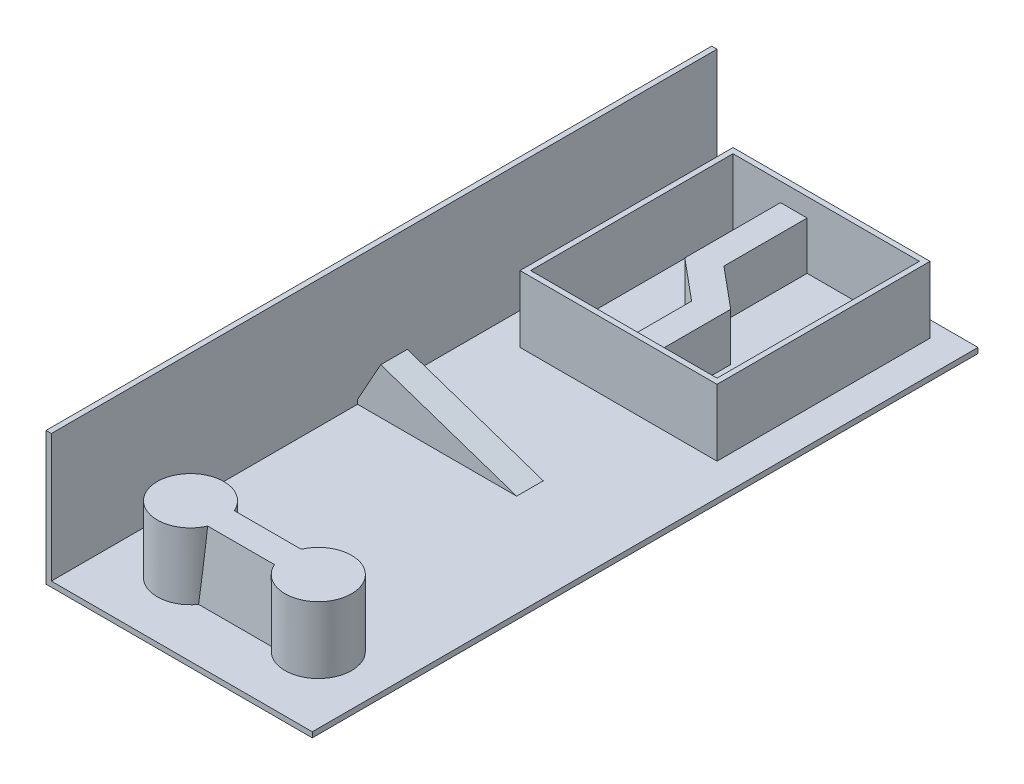
ISO-10303-21;
HEADER;
FILE_DESCRIPTION(('STEP AP214'),'2;1');
FILE_NAME('part.step','',(''),(''),'','','');
FILE_SCHEMA(('AUTOMOTIVE_DESIGN { 1 0 10303 214 1 1 1 1 }'));
ENDSEC;
DATA;
#1=APPLICATION_CONTEXT('core data for automotive mechanical design processes');
#2=APPLICATION_PROTOCOL_DEFINITION('international standard','automotive_design',2000,#1);
#3=PRODUCT_CONTEXT('',#1,'mechanical');
#4=PRODUCT('Part','Part','',(#3));
#5=PRODUCT_RELATED_PRODUCT_CATEGORY('part','',(#4));
#6=PRODUCT_DEFINITION_FORMATION('','',#4);
#7=PRODUCT_DEFINITION_CONTEXT('part definition',#1,'design');
#8=PRODUCT_DEFINITION('design','',#6,#7);
#9=PRODUCT_DEFINITION_SHAPE('','',#8);
#10=(LENGTH_UNIT() NAMED_UNIT(*) SI_UNIT(.MILLI.,.METRE.));
#11=(NAMED_UNIT(*) PLANE_ANGLE_UNIT() SI_UNIT($,.RADIAN.));
#12=(NAMED_UNIT(*) SI_UNIT($,.STERADIAN.) SOLID_ANGLE_UNIT());
#13=UNCERTAINTY_MEASURE_WITH_UNIT(LENGTH_MEASURE(1.E-05),#10,'distance_accuracy_value','');
#14=(GEOMETRIC_REPRESENTATION_CONTEXT(3) GLOBAL_UNCERTAINTY_ASSIGNED_CONTEXT((#13)) GLOBAL_UNIT_ASSIGNED_CONTEXT((#10,
#11,#12)) REPRESENTATION_CONTEXT('',''));
#15=CARTESIAN_POINT('',(0.,0.,0.));
#16=DIRECTION('',(0.,0.,1.));
#17=DIRECTION('',(1.,0.,0.));
#18=AXIS2_PLACEMENT_3D('',#15,#16,#17);
#19=CARTESIAN_POINT('',(100.,2.,250.));
#20=DIRECTION('',(0.,1.,0.));
#21=DIRECTION('',(0.,0.,1.));
#22=AXIS2_PLACEMENT_3D('',#19,#20,#21);
#23=PLANE('',#22);
#24=DIRECTION('',(1.,0.,0.));
#25=VECTOR('',#24,1.);
#26=CARTESIAN_POINT('',(14.,2.,84.));
#27=LINE('',#26,#25);
#28=CARTESIAN_POINT('',(16.,2.,84.));
#29=VERTEX_POINT('',#28);
#30=CARTESIAN_POINT('',(49.1525671305365,2.,84.));
#31=VERTEX_POINT('',#30);
#32=EDGE_CURVE('E361',#29,#31,#27,.T.);
#33=ORIENTED_EDGE('',*,*,#32,.T.);
#34=DIRECTION('',(0.,0.,1.));
#35=VECTOR('',#34,1.);
#36=CARTESIAN_POINT('',(49.1525671305365,2.,250.));
#37=LINE('',#36,#35);
#38=CARTESIAN_POINT('',(49.1525671305365,2.,56.708144933222));
#39=VERTEX_POINT('',#38);
#40=EDGE_CURVE('E11',#39,#31,#37,.T.);
#41=ORIENTED_EDGE('',*,*,#40,.F.);
#42=DIRECTION('',(0.767978867942155,0.,0.640475181716111));
#43=VECTOR('',#42,1.);
#44=CARTESIAN_POINT('',(174.216689275944,2.,161.008497066452));
#45=LINE('',#44,#43);
#46=CARTESIAN_POINT('',(33.8360225709405,2.,43.9345295779502));
#47=VERTEX_POINT('',#46);
#48=EDGE_CURVE('E43',#47,#39,#45,.T.);
#49=ORIENTED_EDGE('',*,*,#48,.F.);
#50=DIRECTION('',(0.,0.,1.));
#51=VECTOR('',#50,1.);
#52=CARTESIAN_POINT('',(33.8360225709405,2.,250.));
#53=LINE('',#52,#51);
#54=CARTESIAN_POINT('',(33.8360225709405,2.,8.));
#55=VERTEX_POINT('',#54);
#56=EDGE_CURVE('E250',#55,#47,#53,.T.);
#57=ORIENTED_EDGE('',*,*,#56,.F.);
#58=DIRECTION('',(-1.,0.,0.));
#59=VECTOR('',#58,1.);
#60=CARTESIAN_POINT('',(14.,2.,8.));
#61=LINE('',#60,#59);
#62=CARTESIAN_POINT('',(16.,2.,8.));
#63=VERTEX_POINT('',#62);
#64=EDGE_CURVE('E354',#55,#63,#61,.T.);
#65=ORIENTED_EDGE('',*,*,#64,.T.);
#66=DIRECTION('',(0.,0.,1.));
#67=VECTOR('',#66,1.);
#68=CARTESIAN_POINT('',(16.,2.,6.));
#69=LINE('',#68,#67);
#70=EDGE_CURVE('E351',#63,#29,#69,.T.);
#71=ORIENTED_EDGE('',*,*,#70,.T.);
#72=EDGE_LOOP('',(#33,#41,#49,#57,#65,#71));
#73=FACE_BOUND('',#72,.T.);
#74=ADVANCED_FACE('F34',(#73),#23,.T.);
#75=CARTESIAN_POINT('',(14.,27.,84.));
#76=DIRECTION('',(0.,0.,-1.));
#77=DIRECTION('',(-1.,0.,0.));
#78=AXIS2_PLACEMENT_3D('',#75,#76,#77);
#79=PLANE('',#78);
#80=DIRECTION('',(1.,0.,0.));
#81=VECTOR('',#80,1.);
#82=CARTESIAN_POINT('',(14.,20.,84.));
#83=LINE('',#82,#81);
#84=CARTESIAN_POINT('',(49.1525671305365,20.,84.));
#85=VERTEX_POINT('',#84);
#86=CARTESIAN_POINT('',(59.1525671305365,20.,84.));
#87=VERTEX_POINT('',#86);
#88=EDGE_CURVE('E275',#85,#87,#83,.T.);
#89=ORIENTED_EDGE('',*,*,#88,.F.);
#90=DIRECTION('',(0.,-1.,0.));
#91=VECTOR('',#90,1.);
#92=CARTESIAN_POINT('',(49.1525671305365,27.,84.));
#93=LINE('',#92,#91);
#94=EDGE_CURVE('E272',#85,#31,#93,.T.);
#95=ORIENTED_EDGE('',*,*,#94,.T.);
#96=ORIENTED_EDGE('',*,*,#32,.F.);
#97=DIRECTION('',(0.,-1.,0.));
#98=VECTOR('',#97,1.);
#99=CARTESIAN_POINT('',(16.,27.,84.));
#100=LINE('',#99,#98);
#101=CARTESIAN_POINT('',(16.,27.,84.));
#102=VERTEX_POINT('',#101);
#103=EDGE_CURVE('E329',#102,#29,#100,.T.);
#104=ORIENTED_EDGE('',*,*,#103,.F.);
#105=DIRECTION('',(1.,0.,0.));
#106=VECTOR('',#105,1.);
#107=CARTESIAN_POINT('',(14.,27.,84.));
#108=LINE('',#107,#106);
#109=CARTESIAN_POINT('',(86.,27.,84.));
#110=VERTEX_POINT('',#109);
#111=EDGE_CURVE('E343',#102,#110,#108,.T.);
#112=ORIENTED_EDGE('',*,*,#111,.T.);
#113=DIRECTION('',(0.,-1.,0.));
#114=VECTOR('',#113,1.);
#115=CARTESIAN_POINT('',(86.,27.,84.));
#116=LINE('',#115,#114);
#117=CARTESIAN_POINT('',(86.,2.,84.));
#118=VERTEX_POINT('',#117);
#119=EDGE_CURVE('E332',#110,#118,#116,.T.);
#120=ORIENTED_EDGE('',*,*,#119,.T.);
#121=CARTESIAN_POINT('',(59.1525671305365,2.,84.));
#122=VERTEX_POINT('',#121);
#123=EDGE_CURVE('E360',#122,#118,#27,.T.);
#124=ORIENTED_EDGE('',*,*,#123,.F.);
#125=DIRECTION('',(0.,-1.,0.));
#126=VECTOR('',#125,1.);
#127=CARTESIAN_POINT('',(59.1525671305365,27.,84.));
#128=LINE('',#127,#126);
#129=EDGE_CURVE('E238',#87,#122,#128,.T.);
#130=ORIENTED_EDGE('',*,*,#129,.F.);
#131=EDGE_LOOP('',(#89,#95,#96,#104,#112,#120,#124,#130));
#132=FACE_BOUND('',#131,.T.);
#133=ADVANCED_FACE('F473',(#132),#79,.T.);
#134=CARTESIAN_POINT('',(2.00000000000001,1.99999999999999,250.));
#135=DIRECTION('',(0.,-1.,0.));
#136=DIRECTION('',(0.,0.,-1.));
#137=AXIS2_PLACEMENT_3D('',#134,#135,#136);
#138=PLANE('',#137);
#139=DIRECTION('',(0.,0.,-1.));
#140=VECTOR('',#139,1.);
#141=CARTESIAN_POINT('',(2.00000000000001,1.99999999999999,250.));
#142=LINE('',#141,#140);
#143=CARTESIAN_POINT('',(2.00000000000001,1.99999999999999,125.));
#144=VERTEX_POINT('',#143);
#145=CARTESIAN_POINT('',(2.00000000000001,1.99999999999999,0.));
#146=VERTEX_POINT('',#145);
#147=EDGE_CURVE('E434',#144,#146,#142,.T.);
#148=ORIENTED_EDGE('',*,*,#147,.F.);
#149=DIRECTION('',(-1.,0.,0.));
#150=VECTOR('',#149,1.);
#151=CARTESIAN_POINT('',(2.00000000000001,1.99999999999999,125.));
#152=LINE('',#151,#150);
#153=CARTESIAN_POINT('',(61.7495471396553,1.99999999999999,125.));
#154=VERTEX_POINT('',#153);
#155=EDGE_CURVE('E293',#154,#144,#152,.T.);
#156=ORIENTED_EDGE('',*,*,#155,.F.);
#157=DIRECTION('',(0.,0.,-1.));
#158=VECTOR('',#157,1.);
#159=CARTESIAN_POINT('',(61.7495471396553,1.99999999999999,250.));
#160=LINE('',#159,#158);
#161=CARTESIAN_POINT('',(61.7495471396553,1.99999999999999,135.));
#162=VERTEX_POINT('',#161);
#163=EDGE_CURVE('E301',#154,#162,#160,.F.);
#164=ORIENTED_EDGE('',*,*,#163,.T.);
#165=DIRECTION('',(-1.,0.,0.));
#166=VECTOR('',#165,1.);
#167=CARTESIAN_POINT('',(2.00000000000001,1.99999999999999,135.));
#168=LINE('',#167,#166);
#169=CARTESIAN_POINT('',(2.00000000000001,1.99999999999999,135.));
#170=VERTEX_POINT('',#169);
#171=EDGE_CURVE('E297',#162,#170,#168,.T.);
#172=ORIENTED_EDGE('',*,*,#171,.T.);
#173=CARTESIAN_POINT('',(2.00000000000001,1.99999999999999,250.));
#174=VERTEX_POINT('',#173);
#175=EDGE_CURVE('E435',#174,#170,#142,.T.);
#176=ORIENTED_EDGE('',*,*,#175,.F.);
#177=DIRECTION('',(-1.,0.,0.));
#178=VECTOR('',#177,1.);
#179=CARTESIAN_POINT('',(2.00000000000001,1.99999999999999,250.));
#180=LINE('',#179,#178);
#181=CARTESIAN_POINT('',(100.,1.99999999999999,250.));
#182=VERTEX_POINT('',#181);
#183=EDGE_CURVE('E406',#182,#174,#180,.T.);
#184=ORIENTED_EDGE('',*,*,#183,.F.);
#185=DIRECTION('',(0.,0.,-1.));
#186=VECTOR('',#185,1.);
#187=CARTESIAN_POINT('',(100.,1.99999999999999,250.));
#188=LINE('',#187,#186);
#189=CARTESIAN_POINT('',(100.,1.99999999999999,0.));
#190=VERTEX_POINT('',#189);
#191=EDGE_CURVE('E438',#182,#190,#188,.T.);
#192=ORIENTED_EDGE('',*,*,#191,.T.);
#193=DIRECTION('',(-1.,0.,0.));
#194=VECTOR('',#193,1.);
#195=CARTESIAN_POINT('',(2.00000000000001,1.99999999999999,0.));
#196=LINE('',#195,#194);
#197=EDGE_CURVE('E419',#190,#146,#196,.T.);
#198=ORIENTED_EDGE('',*,*,#197,.T.);
#199=EDGE_LOOP('',(#148,#156,#164,#172,#176,#184,#192,#198));
#200=FACE_BOUND('',#199,.T.);
#201=CARTESIAN_POINT('',(27.,1.99999999999999,222.734483986752));
#202=DIRECTION('',(0.,-1.,0.));
#203=DIRECTION('',(0.,0.,-1.));
#204=AXIS2_PLACEMENT_3D('',#201,#202,#203);
#205=CIRCLE('',#204,12.5);
#206=CARTESIAN_POINT('',(37.2271167840721,1.99999999999999,215.547267398604));
#207=VERTEX_POINT('',#206);
#208=CARTESIAN_POINT('',(37.2271167840721,1.99999999999999,229.9217005749));
#209=VERTEX_POINT('',#208);
#210=EDGE_CURVE('E443',#207,#209,#205,.F.);
#211=ORIENTED_EDGE('',*,*,#210,.F.);
#212=DIRECTION('',(-1.,0.,0.));
#213=VECTOR('',#212,1.);
#214=CARTESIAN_POINT('',(2.00000000000001,1.99999999999999,215.547267398604));
#215=LINE('',#214,#213);
#216=CARTESIAN_POINT('',(64.7728832159279,1.99999999999999,215.547267398604));
#217=VERTEX_POINT('',#216);
#218=EDGE_CURVE('E320',#217,#207,#215,.T.);
#219=ORIENTED_EDGE('',*,*,#218,.F.);
#220=CARTESIAN_POINT('',(75.,1.99999999999999,222.734483986752));
#221=DIRECTION('',(0.,-1.,0.));
#222=DIRECTION('',(0.,0.,-1.));
#223=AXIS2_PLACEMENT_3D('',#220,#221,#222);
#224=CIRCLE('',#223,12.5);
#225=CARTESIAN_POINT('',(64.7728832159279,1.99999999999999,229.9217005749));
#226=VERTEX_POINT('',#225);
#227=EDGE_CURVE('E446',#226,#217,#224,.F.);
#228=ORIENTED_EDGE('',*,*,#227,.F.);
#229=DIRECTION('',(1.,0.,0.));
#230=VECTOR('',#229,1.);
#231=CARTESIAN_POINT('',(2.00000000000001,1.99999999999999,229.9217005749));
#232=LINE('',#231,#230);
#233=EDGE_CURVE('E322',#209,#226,#232,.T.);
#234=ORIENTED_EDGE('',*,*,#233,.F.);
#235=EDGE_LOOP('',(#211,#219,#228,#234));
#236=FACE_BOUND('',#235,.T.);
#237=DIRECTION('',(0.,0.,-1.));
#238=VECTOR('',#237,1.);
#239=CARTESIAN_POINT('',(88.,1.99999999999999,6.));
#240=LINE('',#239,#238);
#241=CARTESIAN_POINT('',(88.,1.99999999999999,86.));
#242=VERTEX_POINT('',#241);
#243=CARTESIAN_POINT('',(88.,1.99999999999999,6.00000000000001));
#244=VERTEX_POINT('',#243);
#245=EDGE_CURVE('E379',#242,#244,#240,.T.);
#246=ORIENTED_EDGE('',*,*,#245,.F.);
#247=DIRECTION('',(1.,0.,0.));
#248=VECTOR('',#247,1.);
#249=CARTESIAN_POINT('',(14.,1.99999999999999,86.));
#250=LINE('',#249,#248);
#251=CARTESIAN_POINT('',(14.,1.99999999999999,86.));
#252=VERTEX_POINT('',#251);
#253=EDGE_CURVE('E377',#252,#242,#250,.T.);
#254=ORIENTED_EDGE('',*,*,#253,.F.);
#255=DIRECTION('',(0.,0.,1.));
#256=VECTOR('',#255,1.);
#257=CARTESIAN_POINT('',(14.,1.99999999999999,6.));
#258=LINE('',#257,#256);
#259=CARTESIAN_POINT('',(14.,1.99999999999999,6.));
#260=VERTEX_POINT('',#259);
#261=EDGE_CURVE('E363',#260,#252,#258,.T.);
#262=ORIENTED_EDGE('',*,*,#261,.F.);
#263=DIRECTION('',(-1.,0.,0.));
#264=VECTOR('',#263,1.);
#265=CARTESIAN_POINT('',(14.,1.99999999999999,6.));
#266=LINE('',#265,#264);
#267=EDGE_CURVE('E368',#244,#260,#266,.T.);
#268=ORIENTED_EDGE('',*,*,#267,.F.);
#269=EDGE_LOOP('',(#246,#254,#262,#268));
#270=FACE_BOUND('',#269,.T.);
#271=ADVANCED_FACE('F512',(#200,#236,#270),#138,.F.);
#272=CARTESIAN_POINT('',(100.,0.,250.));
#273=DIRECTION('',(0.,1.,0.));
#274=DIRECTION('',(0.,0.,1.));
#275=AXIS2_PLACEMENT_3D('',#272,#273,#274);
#276=PLANE('',#275);
#277=DIRECTION('',(0.,0.,-1.));
#278=VECTOR('',#277,1.);
#279=CARTESIAN_POINT('',(100.,0.,250.));
#280=LINE('',#279,#278);
#281=CARTESIAN_POINT('',(100.,0.,250.));
#282=VERTEX_POINT('',#281);
#283=CARTESIAN_POINT('',(100.,0.,0.));
#284=VERTEX_POINT('',#283);
#285=EDGE_CURVE('E440',#282,#284,#280,.T.);
#286=ORIENTED_EDGE('',*,*,#285,.F.);
#287=DIRECTION('',(1.,0.,0.));
#288=VECTOR('',#287,1.);
#289=CARTESIAN_POINT('',(100.,0.,250.));
#290=LINE('',#289,#288);
#291=CARTESIAN_POINT('',(0.,0.,250.));
#292=VERTEX_POINT('',#291);
#293=EDGE_CURVE('E401',#292,#282,#290,.T.);
#294=ORIENTED_EDGE('',*,*,#293,.F.);
#295=DIRECTION('',(0.,0.,-1.));
#296=VECTOR('',#295,1.);
#297=CARTESIAN_POINT('',(0.,0.,250.));
#298=LINE('',#297,#296);
#299=CARTESIAN_POINT('',(0.,0.,0.));
#300=VERTEX_POINT('',#299);
#301=EDGE_CURVE('E414',#292,#300,#298,.T.);
#302=ORIENTED_EDGE('',*,*,#301,.T.);
#303=DIRECTION('',(1.,0.,0.));
#304=VECTOR('',#303,1.);
#305=CARTESIAN_POINT('',(100.,0.,0.));
#306=LINE('',#305,#304);
#307=EDGE_CURVE('E400',#300,#284,#306,.T.);
#308=ORIENTED_EDGE('',*,*,#307,.T.);
#309=EDGE_LOOP('',(#286,#294,#302,#308));
#310=FACE_BOUND('',#309,.T.);
#311=ADVANCED_FACE('F36',(#310),#276,.F.);
#312=CARTESIAN_POINT('',(100.,1.99999999999999,250.));
#313=DIRECTION('',(-1.,0.,0.));
#314=DIRECTION('',(0.,0.,1.));
#315=AXIS2_PLACEMENT_3D('',#312,#313,#314);
#316=PLANE('',#315);
#317=DIRECTION('',(0.,1.,0.));
#318=VECTOR('',#317,1.);
#319=CARTESIAN_POINT('',(100.,1.99999999999999,0.));
#320=LINE('',#319,#318);
#321=EDGE_CURVE('E416',#284,#190,#320,.T.);
#322=ORIENTED_EDGE('',*,*,#321,.T.);
#323=ORIENTED_EDGE('',*,*,#191,.F.);
#324=DIRECTION('',(0.,1.,0.));
#325=VECTOR('',#324,1.);
#326=CARTESIAN_POINT('',(100.,1.99999999999999,250.));
#327=LINE('',#326,#325);
#328=EDGE_CURVE('E403',#282,#182,#327,.T.);
#329=ORIENTED_EDGE('',*,*,#328,.F.);
#330=ORIENTED_EDGE('',*,*,#285,.T.);
#331=EDGE_LOOP('',(#322,#323,#329,#330));
#332=FACE_BOUND('',#331,.T.);
#333=ADVANCED_FACE('F591',(#332),#316,.F.);
#334=CARTESIAN_POINT('',(2.,50.,250.));
#335=DIRECTION('',(-1.,0.,0.));
#336=DIRECTION('',(0.,-1.,0.));
#337=AXIS2_PLACEMENT_3D('',#334,#335,#336);
#338=PLANE('',#337);
#339=ORIENTED_EDGE('',*,*,#175,.T.);
#340=DIRECTION('',(0.,1.,0.));
#341=VECTOR('',#340,1.);
#342=CARTESIAN_POINT('',(2.,50.,135.));
#343=LINE('',#342,#341);
#344=CARTESIAN_POINT('',(2.00000000000001,3.59068023031592,135.));
#345=VERTEX_POINT('',#344);
#346=EDGE_CURVE('E295',#170,#345,#343,.T.);
#347=ORIENTED_EDGE('',*,*,#346,.T.);
#348=DIRECTION('',(0.,0.,1.));
#349=VECTOR('',#348,1.);
#350=CARTESIAN_POINT('',(2.00000000000001,3.59068023031592,250.));
#351=LINE('',#350,#349);
#352=CARTESIAN_POINT('',(2.,3.59068023031591,125.));
#353=VERTEX_POINT('',#352);
#354=EDGE_CURVE('E299',#345,#353,#351,.F.);
#355=ORIENTED_EDGE('',*,*,#354,.T.);
#356=DIRECTION('',(0.,1.,0.));
#357=VECTOR('',#356,1.);
#358=CARTESIAN_POINT('',(2.,50.,125.));
#359=LINE('',#358,#357);
#360=EDGE_CURVE('E290',#144,#353,#359,.T.);
#361=ORIENTED_EDGE('',*,*,#360,.F.);
#362=ORIENTED_EDGE('',*,*,#147,.T.);
#363=DIRECTION('',(0.,1.,0.));
#364=VECTOR('',#363,1.);
#365=CARTESIAN_POINT('',(2.,50.,0.));
#366=LINE('',#365,#364);
#367=CARTESIAN_POINT('',(2.,50.,0.));
#368=VERTEX_POINT('',#367);
#369=EDGE_CURVE('E421',#146,#368,#366,.T.);
#370=ORIENTED_EDGE('',*,*,#369,.T.);
#371=DIRECTION('',(0.,0.,-1.));
#372=VECTOR('',#371,1.);
#373=CARTESIAN_POINT('',(2.,50.,250.));
#374=LINE('',#373,#372);
#375=CARTESIAN_POINT('',(2.,50.,250.));
#376=VERTEX_POINT('',#375);
#377=EDGE_CURVE('E431',#376,#368,#374,.T.);
#378=ORIENTED_EDGE('',*,*,#377,.F.);
#379=DIRECTION('',(0.,1.,0.));
#380=VECTOR('',#379,1.);
#381=CARTESIAN_POINT('',(2.,50.,250.));
#382=LINE('',#381,#380);
#383=EDGE_CURVE('E408',#174,#376,#382,.T.);
#384=ORIENTED_EDGE('',*,*,#383,.F.);
#385=EDGE_LOOP('',(#339,#347,#355,#361,#362,#370,#378,#384));
#386=FACE_BOUND('',#385,.T.);
#387=ADVANCED_FACE('F587',(#386),#338,.F.);
#388=CARTESIAN_POINT('',(0.,50.,250.));
#389=DIRECTION('',(0.,-1.,0.));
#390=DIRECTION('',(0.,0.,-1.));
#391=AXIS2_PLACEMENT_3D('',#388,#389,#390);
#392=PLANE('',#391);
#393=DIRECTION('',(-1.,0.,0.));
#394=VECTOR('',#393,1.);
#395=CARTESIAN_POINT('',(0.,50.,0.));
#396=LINE('',#395,#394);
#397=CARTESIAN_POINT('',(0.,50.,0.));
#398=VERTEX_POINT('',#397);
#399=EDGE_CURVE('E423',#368,#398,#396,.T.);
#400=ORIENTED_EDGE('',*,*,#399,.T.);
#401=DIRECTION('',(0.,0.,-1.));
#402=VECTOR('',#401,1.);
#403=CARTESIAN_POINT('',(0.,50.,250.));
#404=LINE('',#403,#402);
#405=CARTESIAN_POINT('',(0.,50.,250.));
#406=VERTEX_POINT('',#405);
#407=EDGE_CURVE('E428',#406,#398,#404,.T.);
#408=ORIENTED_EDGE('',*,*,#407,.F.);
#409=DIRECTION('',(-1.,0.,0.));
#410=VECTOR('',#409,1.);
#411=CARTESIAN_POINT('',(0.,50.,250.));
#412=LINE('',#411,#410);
#413=EDGE_CURVE('E410',#376,#406,#412,.T.);
#414=ORIENTED_EDGE('',*,*,#413,.F.);
#415=ORIENTED_EDGE('',*,*,#377,.T.);
#416=EDGE_LOOP('',(#400,#408,#414,#415));
#417=FACE_BOUND('',#416,.T.);
#418=ADVANCED_FACE('F583',(#417),#392,.F.);
#419=CARTESIAN_POINT('',(0.,0.,250.));
#420=DIRECTION('',(1.,0.,0.));
#421=DIRECTION('',(0.,0.,-1.));
#422=AXIS2_PLACEMENT_3D('',#419,#420,#421);
#423=PLANE('',#422);
#424=DIRECTION('',(0.,-1.,0.));
#425=VECTOR('',#424,1.);
#426=CARTESIAN_POINT('',(0.,0.,0.));
#427=LINE('',#426,#425);
#428=EDGE_CURVE('E404',#398,#300,#427,.T.);
#429=ORIENTED_EDGE('',*,*,#428,.T.);
#430=ORIENTED_EDGE('',*,*,#301,.F.);
#431=DIRECTION('',(0.,-1.,0.));
#432=VECTOR('',#431,1.);
#433=CARTESIAN_POINT('',(0.,0.,250.));
#434=LINE('',#433,#432);
#435=EDGE_CURVE('E412',#406,#292,#434,.T.);
#436=ORIENTED_EDGE('',*,*,#435,.F.);
#437=ORIENTED_EDGE('',*,*,#407,.T.);
#438=EDGE_LOOP('',(#429,#430,#436,#437));
#439=FACE_BOUND('',#438,.T.);
#440=ADVANCED_FACE('F576',(#439),#423,.F.);
#441=CARTESIAN_POINT('',(0.,0.,250.));
#442=DIRECTION('',(0.,0.,-1.));
#443=DIRECTION('',(-1.,0.,0.));
#444=AXIS2_PLACEMENT_3D('',#441,#442,#443);
#445=PLANE('',#444);
#446=ORIENTED_EDGE('',*,*,#183,.T.);
#447=ORIENTED_EDGE('',*,*,#383,.T.);
#448=ORIENTED_EDGE('',*,*,#413,.T.);
#449=ORIENTED_EDGE('',*,*,#435,.T.);
#450=ORIENTED_EDGE('',*,*,#293,.T.);
#451=ORIENTED_EDGE('',*,*,#328,.T.);
#452=EDGE_LOOP('',(#446,#447,#448,#449,#450,#451));
#453=FACE_BOUND('',#452,.T.);
#454=ADVANCED_FACE('F573',(#453),#445,.F.);
#455=CARTESIAN_POINT('',(0.,0.,0.));
#456=DIRECTION('',(0.,0.,-1.));
#457=DIRECTION('',(-1.,0.,0.));
#458=AXIS2_PLACEMENT_3D('',#455,#456,#457);
#459=PLANE('',#458);
#460=ORIENTED_EDGE('',*,*,#369,.F.);
#461=ORIENTED_EDGE('',*,*,#197,.F.);
#462=ORIENTED_EDGE('',*,*,#321,.F.);
#463=ORIENTED_EDGE('',*,*,#307,.F.);
#464=ORIENTED_EDGE('',*,*,#428,.F.);
#465=ORIENTED_EDGE('',*,*,#399,.F.);
#466=EDGE_LOOP('',(#460,#461,#462,#463,#464,#465));
#467=FACE_BOUND('',#466,.T.);
#468=ADVANCED_FACE('F571',(#467),#459,.T.);
#469=CARTESIAN_POINT('',(27.,27.,222.734483986752));
#470=DIRECTION('',(0.,-1.,0.));
#471=DIRECTION('',(0.,0.,-1.));
#472=AXIS2_PLACEMENT_3D('',#469,#470,#471);
#473=CYLINDRICAL_SURFACE('',#472,12.5);
#474=ORIENTED_EDGE('',*,*,#210,.T.);
#475=CARTESIAN_POINT('',(27.,84.1502615138066,222.734483986752));
#476=DIRECTION('',(0.,-0.0871557427476584,-0.996194698091746));
#477=DIRECTION('',(0.,-0.996194698091746,0.0871557427476584));
#478=AXIS2_PLACEMENT_3D('',#475,#476,#477);
#479=ELLIPSE('',#478,143.421415570873,12.5);
#480=CARTESIAN_POINT('',(38.4564392373896,27.,227.734483986752));
#481=VERTEX_POINT('',#480);
#482=EDGE_CURVE('E314',#209,#481,#479,.F.);
#483=ORIENTED_EDGE('',*,*,#482,.T.);
#484=CARTESIAN_POINT('',(27.,27.,222.734483986752));
#485=DIRECTION('',(0.,1.,0.));
#486=DIRECTION('',(0.,0.,1.));
#487=AXIS2_PLACEMENT_3D('',#484,#485,#486);
#488=CIRCLE('',#487,12.5);
#489=CARTESIAN_POINT('',(38.4564392373896,27.,217.734483986752));
#490=VERTEX_POINT('',#489);
#491=EDGE_CURVE('E397',#490,#481,#488,.T.);
#492=ORIENTED_EDGE('',*,*,#491,.F.);
#493=CARTESIAN_POINT('',(27.,84.1502615138066,222.734483986752));
#494=DIRECTION('',(0.,-0.0871557427476584,0.996194698091746));
#495=DIRECTION('',(0.,-0.996194698091746,-0.0871557427476584));
#496=AXIS2_PLACEMENT_3D('',#493,#494,#495);
#497=ELLIPSE('',#496,143.421415570873,12.5);
#498=EDGE_CURVE('E317',#207,#490,#497,.T.);
#499=ORIENTED_EDGE('',*,*,#498,.F.);
#500=EDGE_LOOP('',(#474,#483,#492,#499));
#501=FACE_BOUND('',#500,.T.);
#502=ADVANCED_FACE('F567',(#501),#473,.T.);
#503=CARTESIAN_POINT('',(27.,27.,222.734483986752));
#504=DIRECTION('',(0.,1.,0.));
#505=DIRECTION('',(0.,0.,1.));
#506=AXIS2_PLACEMENT_3D('',#503,#504,#505);
#507=PLANE('',#506);
#508=ORIENTED_EDGE('',*,*,#491,.T.);
#509=DIRECTION('',(-1.,0.,0.));
#510=VECTOR('',#509,1.);
#511=CARTESIAN_POINT('',(39.5,27.,227.734483986752));
#512=LINE('',#511,#510);
#513=CARTESIAN_POINT('',(63.5435607626104,27.,227.734483986752));
#514=VERTEX_POINT('',#513);
#515=EDGE_CURVE('E304',#481,#514,#512,.F.);
#516=ORIENTED_EDGE('',*,*,#515,.T.);
#517=CARTESIAN_POINT('',(75.,27.,222.734483986752));
#518=DIRECTION('',(0.,1.,0.));
#519=DIRECTION('',(0.,0.,1.));
#520=AXIS2_PLACEMENT_3D('',#517,#518,#519);
#521=CIRCLE('',#520,12.5);
#522=CARTESIAN_POINT('',(63.5435607626104,27.,217.734483986752));
#523=VERTEX_POINT('',#522);
#524=EDGE_CURVE('E394',#514,#523,#521,.T.);
#525=ORIENTED_EDGE('',*,*,#524,.T.);
#526=DIRECTION('',(-1.,0.,0.));
#527=VECTOR('',#526,1.);
#528=CARTESIAN_POINT('',(39.5,27.,217.734483986752));
#529=LINE('',#528,#527);
#530=EDGE_CURVE('E305',#490,#523,#529,.F.);
#531=ORIENTED_EDGE('',*,*,#530,.F.);
#532=EDGE_LOOP('',(#508,#516,#525,#531));
#533=FACE_BOUND('',#532,.T.);
#534=ADVANCED_FACE('F563',(#533),#507,.T.);
#535=CARTESIAN_POINT('',(75.,27.,222.734483986752));
#536=DIRECTION('',(0.,-1.,0.));
#537=DIRECTION('',(0.,0.,-1.));
#538=AXIS2_PLACEMENT_3D('',#535,#536,#537);
#539=CYLINDRICAL_SURFACE('',#538,12.5);
#540=ORIENTED_EDGE('',*,*,#227,.T.);
#541=CARTESIAN_POINT('',(75.,84.1502615138066,222.734483986752));
#542=DIRECTION('',(0.,-0.0871557427476584,0.996194698091746));
#543=DIRECTION('',(0.,-0.996194698091746,-0.0871557427476584));
#544=AXIS2_PLACEMENT_3D('',#541,#542,#543);
#545=ELLIPSE('',#544,143.421415570873,12.5);
#546=EDGE_CURVE('E311',#217,#523,#545,.F.);
#547=ORIENTED_EDGE('',*,*,#546,.T.);
#548=ORIENTED_EDGE('',*,*,#524,.F.);
#549=CARTESIAN_POINT('',(75.,84.1502615138066,222.734483986752));
#550=DIRECTION('',(0.,-0.0871557427476584,-0.996194698091746));
#551=DIRECTION('',(0.,-0.996194698091746,0.0871557427476584));
#552=AXIS2_PLACEMENT_3D('',#549,#550,#551);
#553=ELLIPSE('',#552,143.421415570873,12.5);
#554=EDGE_CURVE('E307',#226,#514,#553,.T.);
#555=ORIENTED_EDGE('',*,*,#554,.F.);
#556=EDGE_LOOP('',(#540,#547,#548,#555));
#557=FACE_BOUND('',#556,.T.);
#558=ADVANCED_FACE('F560',(#557),#539,.T.);
#559=CARTESIAN_POINT('',(14.,27.,6.));
#560=DIRECTION('',(1.,0.,0.));
#561=DIRECTION('',(0.,0.,-1.));
#562=AXIS2_PLACEMENT_3D('',#559,#560,#561);
#563=PLANE('',#562);
#564=ORIENTED_EDGE('',*,*,#261,.T.);
#565=DIRECTION('',(0.,-1.,0.));
#566=VECTOR('',#565,1.);
#567=CARTESIAN_POINT('',(14.,27.,86.));
#568=LINE('',#567,#566);
#569=CARTESIAN_POINT('',(14.,27.,86.));
#570=VERTEX_POINT('',#569);
#571=EDGE_CURVE('E391',#570,#252,#568,.T.);
#572=ORIENTED_EDGE('',*,*,#571,.F.);
#573=DIRECTION('',(0.,0.,1.));
#574=VECTOR('',#573,1.);
#575=CARTESIAN_POINT('',(14.,27.,6.));
#576=LINE('',#575,#574);
#577=CARTESIAN_POINT('',(14.,27.,6.));
#578=VERTEX_POINT('',#577);
#579=EDGE_CURVE('E364',#578,#570,#576,.T.);
#580=ORIENTED_EDGE('',*,*,#579,.F.);
#581=DIRECTION('',(0.,-1.,0.));
#582=VECTOR('',#581,1.);
#583=CARTESIAN_POINT('',(14.,27.,6.));
#584=LINE('',#583,#582);
#585=EDGE_CURVE('E374',#578,#260,#584,.T.);
#586=ORIENTED_EDGE('',*,*,#585,.T.);
#587=EDGE_LOOP('',(#564,#572,#580,#586));
#588=FACE_BOUND('',#587,.T.);
#589=ADVANCED_FACE('F556',(#588),#563,.F.);
#590=CARTESIAN_POINT('',(14.,27.,86.));
#591=DIRECTION('',(0.,0.,-1.));
#592=DIRECTION('',(-1.,0.,0.));
#593=AXIS2_PLACEMENT_3D('',#590,#591,#592);
#594=PLANE('',#593);
#595=ORIENTED_EDGE('',*,*,#253,.T.);
#596=DIRECTION('',(0.,-1.,0.));
#597=VECTOR('',#596,1.);
#598=CARTESIAN_POINT('',(88.,27.,86.));
#599=LINE('',#598,#597);
#600=CARTESIAN_POINT('',(88.,27.,86.));
#601=VERTEX_POINT('',#600);
#602=EDGE_CURVE('E388',#601,#242,#599,.T.);
#603=ORIENTED_EDGE('',*,*,#602,.F.);
#604=DIRECTION('',(1.,0.,0.));
#605=VECTOR('',#604,1.);
#606=CARTESIAN_POINT('',(14.,27.,86.));
#607=LINE('',#606,#605);
#608=EDGE_CURVE('E367',#570,#601,#607,.T.);
#609=ORIENTED_EDGE('',*,*,#608,.F.);
#610=ORIENTED_EDGE('',*,*,#571,.T.);
#611=EDGE_LOOP('',(#595,#603,#609,#610));
#612=FACE_BOUND('',#611,.T.);
#613=ADVANCED_FACE('F552',(#612),#594,.F.);
#614=CARTESIAN_POINT('',(88.,27.,6.));
#615=DIRECTION('',(-1.,0.,0.));
#616=DIRECTION('',(0.,0.,1.));
#617=AXIS2_PLACEMENT_3D('',#614,#615,#616);
#618=PLANE('',#617);
#619=ORIENTED_EDGE('',*,*,#245,.T.);
#620=DIRECTION('',(0.,-1.,0.));
#621=VECTOR('',#620,1.);
#622=CARTESIAN_POINT('',(88.,27.,6.));
#623=LINE('',#622,#621);
#624=CARTESIAN_POINT('',(88.,27.,6.));
#625=VERTEX_POINT('',#624);
#626=EDGE_CURVE('E385',#625,#244,#623,.T.);
#627=ORIENTED_EDGE('',*,*,#626,.F.);
#628=DIRECTION('',(0.,0.,-1.));
#629=VECTOR('',#628,1.);
#630=CARTESIAN_POINT('',(88.,27.,6.));
#631=LINE('',#630,#629);
#632=EDGE_CURVE('E370',#601,#625,#631,.T.);
#633=ORIENTED_EDGE('',*,*,#632,.F.);
#634=ORIENTED_EDGE('',*,*,#602,.T.);
#635=EDGE_LOOP('',(#619,#627,#633,#634));
#636=FACE_BOUND('',#635,.T.);
#637=ADVANCED_FACE('F548',(#636),#618,.F.);
#638=CARTESIAN_POINT('',(14.,27.,6.));
#639=DIRECTION('',(0.,0.,1.));
#640=DIRECTION('',(1.,0.,0.));
#641=AXIS2_PLACEMENT_3D('',#638,#639,#640);
#642=PLANE('',#641);
#643=ORIENTED_EDGE('',*,*,#267,.T.);
#644=ORIENTED_EDGE('',*,*,#585,.F.);
#645=DIRECTION('',(-1.,0.,0.));
#646=VECTOR('',#645,1.);
#647=CARTESIAN_POINT('',(14.,27.,6.));
#648=LINE('',#647,#646);
#649=EDGE_CURVE('E372',#625,#578,#648,.T.);
#650=ORIENTED_EDGE('',*,*,#649,.F.);
#651=ORIENTED_EDGE('',*,*,#626,.T.);
#652=EDGE_LOOP('',(#643,#644,#650,#651));
#653=FACE_BOUND('',#652,.T.);
#654=ADVANCED_FACE('F545',(#653),#642,.F.);
#655=CARTESIAN_POINT('',(0.,27.,0.));
#656=DIRECTION('',(0.,1.,0.));
#657=DIRECTION('',(0.,0.,1.));
#658=AXIS2_PLACEMENT_3D('',#655,#656,#657);
#659=PLANE('',#658);
#660=DIRECTION('',(0.,0.,1.));
#661=VECTOR('',#660,1.);
#662=CARTESIAN_POINT('',(16.,27.,6.));
#663=LINE('',#662,#661);
#664=CARTESIAN_POINT('',(16.,27.,8.));
#665=VERTEX_POINT('',#664);
#666=EDGE_CURVE('E324',#665,#102,#663,.T.);
#667=ORIENTED_EDGE('',*,*,#666,.F.);
#668=DIRECTION('',(-1.,0.,0.));
#669=VECTOR('',#668,1.);
#670=CARTESIAN_POINT('',(14.,27.,8.));
#671=LINE('',#670,#669);
#672=CARTESIAN_POINT('',(86.,27.,8.));
#673=VERTEX_POINT('',#672);
#674=EDGE_CURVE('E337',#673,#665,#671,.T.);
#675=ORIENTED_EDGE('',*,*,#674,.F.);
#676=DIRECTION('',(0.,0.,-1.));
#677=VECTOR('',#676,1.);
#678=CARTESIAN_POINT('',(86.,27.,6.));
#679=LINE('',#678,#677);
#680=EDGE_CURVE('E345',#110,#673,#679,.T.);
#681=ORIENTED_EDGE('',*,*,#680,.F.);
#682=ORIENTED_EDGE('',*,*,#111,.F.);
#683=EDGE_LOOP('',(#667,#675,#681,#682));
#684=FACE_BOUND('',#683,.T.);
#685=ORIENTED_EDGE('',*,*,#579,.T.);
#686=ORIENTED_EDGE('',*,*,#608,.T.);
#687=ORIENTED_EDGE('',*,*,#632,.T.);
#688=ORIENTED_EDGE('',*,*,#649,.T.);
#689=EDGE_LOOP('',(#685,#686,#687,#688));
#690=FACE_BOUND('',#689,.T.);
#691=ADVANCED_FACE('F478',(#684,#690),#659,.T.);
#692=DIRECTION('',(0.,0.,1.));
#693=VECTOR('',#692,1.);
#694=CARTESIAN_POINT('',(59.1525671305365,2.,250.));
#695=LINE('',#694,#693);
#696=CARTESIAN_POINT('',(59.1525671305365,2.,52.0267033820077));
#697=VERTEX_POINT('',#696);
#698=EDGE_CURVE('E451',#697,#122,#695,.T.);
#699=ORIENTED_EDGE('',*,*,#698,.T.);
#700=ORIENTED_EDGE('',*,*,#123,.T.);
#701=DIRECTION('',(0.,0.,-1.));
#702=VECTOR('',#701,1.);
#703=CARTESIAN_POINT('',(86.,2.,6.));
#704=LINE('',#703,#702);
#705=CARTESIAN_POINT('',(86.,2.,8.));
#706=VERTEX_POINT('',#705);
#707=EDGE_CURVE('E358',#118,#706,#704,.T.);
#708=ORIENTED_EDGE('',*,*,#707,.T.);
#709=CARTESIAN_POINT('',(43.8360225709405,2.,8.));
#710=VERTEX_POINT('',#709);
#711=EDGE_CURVE('E355',#706,#710,#61,.T.);
#712=ORIENTED_EDGE('',*,*,#711,.T.);
#713=DIRECTION('',(0.,0.,1.));
#714=VECTOR('',#713,1.);
#715=CARTESIAN_POINT('',(43.8360225709405,2.,250.));
#716=LINE('',#715,#714);
#717=CARTESIAN_POINT('',(43.8360225709405,2.,39.253088026736));
#718=VERTEX_POINT('',#717);
#719=EDGE_CURVE('E455',#710,#718,#716,.T.);
#720=ORIENTED_EDGE('',*,*,#719,.T.);
#721=DIRECTION('',(0.767978867942155,0.,0.640475181716111));
#722=VECTOR('',#721,1.);
#723=CARTESIAN_POINT('',(180.621441093105,2.,153.32870838703));
#724=LINE('',#723,#722);
#725=EDGE_CURVE('E453',#718,#697,#724,.T.);
#726=ORIENTED_EDGE('',*,*,#725,.T.);
#727=EDGE_LOOP('',(#699,#700,#708,#712,#720,#726));
#728=FACE_BOUND('',#727,.T.);
#729=ADVANCED_FACE('F464',(#728),#23,.T.);
#730=CARTESIAN_POINT('',(16.,27.,6.));
#731=DIRECTION('',(1.,0.,0.));
#732=DIRECTION('',(0.,0.,-1.));
#733=AXIS2_PLACEMENT_3D('',#730,#731,#732);
#734=PLANE('',#733);
#735=DIRECTION('',(0.,-1.,0.));
#736=VECTOR('',#735,1.);
#737=CARTESIAN_POINT('',(16.,27.,8.));
#738=LINE('',#737,#736);
#739=EDGE_CURVE('E333',#665,#63,#738,.T.);
#740=ORIENTED_EDGE('',*,*,#739,.F.);
#741=ORIENTED_EDGE('',*,*,#666,.T.);
#742=ORIENTED_EDGE('',*,*,#103,.T.);
#743=ORIENTED_EDGE('',*,*,#70,.F.);
#744=EDGE_LOOP('',(#740,#741,#742,#743));
#745=FACE_BOUND('',#744,.T.);
#746=ADVANCED_FACE('F485',(#745),#734,.T.);
#747=CARTESIAN_POINT('',(14.,27.,8.));
#748=DIRECTION('',(0.,0.,1.));
#749=DIRECTION('',(1.,0.,0.));
#750=AXIS2_PLACEMENT_3D('',#747,#748,#749);
#751=PLANE('',#750);
#752=DIRECTION('',(0.,-1.,0.));
#753=VECTOR('',#752,1.);
#754=CARTESIAN_POINT('',(33.8360225709405,27.,8.));
#755=LINE('',#754,#753);
#756=CARTESIAN_POINT('',(33.8360225709405,20.,8.));
#757=VERTEX_POINT('',#756);
#758=EDGE_CURVE('E456',#757,#55,#755,.T.);
#759=ORIENTED_EDGE('',*,*,#758,.F.);
#760=DIRECTION('',(-1.,0.,0.));
#761=VECTOR('',#760,1.);
#762=CARTESIAN_POINT('',(14.,20.,8.));
#763=LINE('',#762,#761);
#764=CARTESIAN_POINT('',(43.8360225709405,20.,8.));
#765=VERTEX_POINT('',#764);
#766=EDGE_CURVE('E244',#765,#757,#763,.T.);
#767=ORIENTED_EDGE('',*,*,#766,.F.);
#768=DIRECTION('',(0.,-1.,0.));
#769=VECTOR('',#768,1.);
#770=CARTESIAN_POINT('',(43.8360225709405,27.,8.));
#771=LINE('',#770,#769);
#772=EDGE_CURVE('E38',#765,#710,#771,.T.);
#773=ORIENTED_EDGE('',*,*,#772,.T.);
#774=ORIENTED_EDGE('',*,*,#711,.F.);
#775=DIRECTION('',(0.,-1.,0.));
#776=VECTOR('',#775,1.);
#777=CARTESIAN_POINT('',(86.,27.,8.));
#778=LINE('',#777,#776);
#779=EDGE_CURVE('E336',#673,#706,#778,.T.);
#780=ORIENTED_EDGE('',*,*,#779,.F.);
#781=ORIENTED_EDGE('',*,*,#674,.T.);
#782=ORIENTED_EDGE('',*,*,#739,.T.);
#783=ORIENTED_EDGE('',*,*,#64,.F.);
#784=EDGE_LOOP('',(#759,#767,#773,#774,#780,#781,#782,#783));
#785=FACE_BOUND('',#784,.T.);
#786=ADVANCED_FACE('F461',(#785),#751,.T.);
#787=CARTESIAN_POINT('',(86.,27.,6.));
#788=DIRECTION('',(-1.,0.,0.));
#789=DIRECTION('',(0.,0.,1.));
#790=AXIS2_PLACEMENT_3D('',#787,#788,#789);
#791=PLANE('',#790);
#792=ORIENTED_EDGE('',*,*,#119,.F.);
#793=ORIENTED_EDGE('',*,*,#680,.T.);
#794=ORIENTED_EDGE('',*,*,#779,.T.);
#795=ORIENTED_EDGE('',*,*,#707,.F.);
#796=EDGE_LOOP('',(#792,#793,#794,#795));
#797=FACE_BOUND('',#796,.T.);
#798=ADVANCED_FACE('F470',(#797),#791,.T.);
#799=CARTESIAN_POINT('',(39.5,27.,217.734483986752));
#800=DIRECTION('',(0.,-0.0871557427476584,0.996194698091746));
#801=DIRECTION('',(0.,-0.996194698091746,-0.0871557427476584));
#802=AXIS2_PLACEMENT_3D('',#799,#800,#801);
#803=PLANE('',#802);
#804=ORIENTED_EDGE('',*,*,#218,.T.);
#805=ORIENTED_EDGE('',*,*,#498,.T.);
#806=ORIENTED_EDGE('',*,*,#530,.T.);
#807=ORIENTED_EDGE('',*,*,#546,.F.);
#808=EDGE_LOOP('',(#804,#805,#806,#807));
#809=FACE_BOUND('',#808,.T.);
#810=ADVANCED_FACE('F540',(#809),#803,.F.);
#811=CARTESIAN_POINT('',(39.5,27.,227.734483986752));
#812=DIRECTION('',(0.,-0.0871557427476584,-0.996194698091746));
#813=DIRECTION('',(0.,0.996194698091746,-0.0871557427476584));
#814=AXIS2_PLACEMENT_3D('',#811,#812,#813);
#815=PLANE('',#814);
#816=ORIENTED_EDGE('',*,*,#233,.T.);
#817=ORIENTED_EDGE('',*,*,#554,.T.);
#818=ORIENTED_EDGE('',*,*,#515,.F.);
#819=ORIENTED_EDGE('',*,*,#482,.F.);
#820=EDGE_LOOP('',(#816,#817,#818,#819));
#821=FACE_BOUND('',#820,.T.);
#822=ADVANCED_FACE('F653',(#821),#815,.F.);
#823=CARTESIAN_POINT('',(10.7139335222541,19.2351546436385,130.));
#824=DIRECTION('',(-0.31995588018515,-0.94743244336203,0.));
#825=DIRECTION('',(0.94743244336203,-0.31995588018515,0.));
#826=AXIS2_PLACEMENT_3D('',#823,#824,#825);
#827=PLANE('',#826);
#828=ORIENTED_EDGE('',*,*,#163,.F.);
#829=DIRECTION('',(0.94743244336203,-0.31995588018515,0.));
#830=VECTOR('',#829,1.);
#831=CARTESIAN_POINT('',(10.7139335222541,19.2351546436385,125.));
#832=LINE('',#831,#830);
#833=CARTESIAN_POINT('',(10.7139335222541,19.2351546436385,125.));
#834=VERTEX_POINT('',#833);
#835=EDGE_CURVE('E279',#834,#154,#832,.T.);
#836=ORIENTED_EDGE('',*,*,#835,.F.);
#837=DIRECTION('',(0.,0.,1.));
#838=VECTOR('',#837,1.);
#839=CARTESIAN_POINT('',(10.7139335222541,19.2351546436385,130.));
#840=LINE('',#839,#838);
#841=CARTESIAN_POINT('',(10.7139335222541,19.2351546436385,135.));
#842=VERTEX_POINT('',#841);
#843=EDGE_CURVE('E282',#834,#842,#840,.T.);
#844=ORIENTED_EDGE('',*,*,#843,.T.);
#845=DIRECTION('',(0.94743244336203,-0.31995588018515,0.));
#846=VECTOR('',#845,1.);
#847=CARTESIAN_POINT('',(10.7139335222541,19.2351546436385,135.));
#848=LINE('',#847,#846);
#849=EDGE_CURVE('E283',#842,#162,#848,.T.);
#850=ORIENTED_EDGE('',*,*,#849,.T.);
#851=EDGE_LOOP('',(#828,#836,#844,#850));
#852=FACE_BOUND('',#851,.T.);
#853=ADVANCED_FACE('F629',(#852),#827,.F.);
#854=CARTESIAN_POINT('',(0.,0.,130.));
#855=DIRECTION('',(0.873621952580905,-0.48660526504419,0.));
#856=DIRECTION('',(0.48660526504419,0.873621952580905,0.));
#857=AXIS2_PLACEMENT_3D('',#854,#855,#856);
#858=PLANE('',#857);
#859=ORIENTED_EDGE('',*,*,#354,.F.);
#860=DIRECTION('',(0.48660526504419,0.873621952580905,0.));
#861=VECTOR('',#860,1.);
#862=CARTESIAN_POINT('',(0.,0.,135.));
#863=LINE('',#862,#861);
#864=EDGE_CURVE('E280',#345,#842,#863,.T.);
#865=ORIENTED_EDGE('',*,*,#864,.T.);
#866=ORIENTED_EDGE('',*,*,#843,.F.);
#867=DIRECTION('',(0.48660526504419,0.873621952580905,0.));
#868=VECTOR('',#867,1.);
#869=CARTESIAN_POINT('',(0.,0.,125.));
#870=LINE('',#869,#868);
#871=EDGE_CURVE('E285',#353,#834,#870,.T.);
#872=ORIENTED_EDGE('',*,*,#871,.F.);
#873=EDGE_LOOP('',(#859,#865,#866,#872));
#874=FACE_BOUND('',#873,.T.);
#875=ADVANCED_FACE('F623',(#874),#858,.F.);
#876=CARTESIAN_POINT('',(50.,25.,135.));
#877=DIRECTION('',(0.,0.,1.));
#878=DIRECTION('',(1.,0.,0.));
#879=AXIS2_PLACEMENT_3D('',#876,#877,#878);
#880=PLANE('',#879);
#881=ORIENTED_EDGE('',*,*,#171,.F.);
#882=ORIENTED_EDGE('',*,*,#849,.F.);
#883=ORIENTED_EDGE('',*,*,#864,.F.);
#884=ORIENTED_EDGE('',*,*,#346,.F.);
#885=EDGE_LOOP('',(#881,#882,#883,#884));
#886=FACE_BOUND('',#885,.T.);
#887=ADVANCED_FACE('F634',(#886),#880,.T.);
#888=CARTESIAN_POINT('',(50.,25.,125.));
#889=DIRECTION('',(0.,0.,1.));
#890=DIRECTION('',(1.,0.,0.));
#891=AXIS2_PLACEMENT_3D('',#888,#889,#890);
#892=PLANE('',#891);
#893=ORIENTED_EDGE('',*,*,#155,.T.);
#894=ORIENTED_EDGE('',*,*,#360,.T.);
#895=ORIENTED_EDGE('',*,*,#871,.T.);
#896=ORIENTED_EDGE('',*,*,#835,.T.);
#897=EDGE_LOOP('',(#893,#894,#895,#896));
#898=FACE_BOUND('',#897,.T.);
#899=ADVANCED_FACE('F620',(#898),#892,.F.);
#900=CARTESIAN_POINT('',(49.1525671305365,20.,74.5616816840844));
#901=DIRECTION('',(1.,0.,0.));
#902=DIRECTION('',(0.,0.,-1.));
#903=AXIS2_PLACEMENT_3D('',#900,#901,#902);
#904=PLANE('',#903);
#905=ORIENTED_EDGE('',*,*,#40,.T.);
#906=ORIENTED_EDGE('',*,*,#94,.F.);
#907=DIRECTION('',(0.,0.,-1.));
#908=VECTOR('',#907,1.);
#909=CARTESIAN_POINT('',(49.1525671305365,20.,74.5616816840844));
#910=LINE('',#909,#908);
#911=CARTESIAN_POINT('',(49.1525671305365,20.,56.708144933222));
#912=VERTEX_POINT('',#911);
#913=EDGE_CURVE('E251',#912,#85,#910,.F.);
#914=ORIENTED_EDGE('',*,*,#913,.F.);
#915=DIRECTION('',(0.,-1.,0.));
#916=VECTOR('',#915,1.);
#917=CARTESIAN_POINT('',(49.1525671305365,20.,56.708144933222));
#918=LINE('',#917,#916);
#919=EDGE_CURVE('E235',#912,#39,#918,.T.);
#920=ORIENTED_EDGE('',*,*,#919,.T.);
#921=EDGE_LOOP('',(#905,#906,#914,#920));
#922=FACE_BOUND('',#921,.T.);
#923=ADVANCED_FACE('F488',(#922),#904,.F.);
#924=CARTESIAN_POINT('',(59.1525671305365,20.,74.5616816840844));
#925=DIRECTION('',(1.,0.,0.));
#926=DIRECTION('',(0.,0.,-1.));
#927=AXIS2_PLACEMENT_3D('',#924,#925,#926);
#928=PLANE('',#927);
#929=ORIENTED_EDGE('',*,*,#129,.T.);
#930=ORIENTED_EDGE('',*,*,#698,.F.);
#931=DIRECTION('',(0.,-1.,0.));
#932=VECTOR('',#931,1.);
#933=CARTESIAN_POINT('',(59.1525671305365,20.,52.0267033820077));
#934=LINE('',#933,#932);
#935=CARTESIAN_POINT('',(59.1525671305365,20.,52.0267033820077));
#936=VERTEX_POINT('',#935);
#937=EDGE_CURVE('E257',#936,#697,#934,.T.);
#938=ORIENTED_EDGE('',*,*,#937,.F.);
#939=DIRECTION('',(0.,0.,-1.));
#940=VECTOR('',#939,1.);
#941=CARTESIAN_POINT('',(59.1525671305365,20.,74.5616816840844));
#942=LINE('',#941,#940);
#943=EDGE_CURVE('E263',#936,#87,#942,.F.);
#944=ORIENTED_EDGE('',*,*,#943,.T.);
#945=EDGE_LOOP('',(#929,#930,#938,#944));
#946=FACE_BOUND('',#945,.T.);
#947=ADVANCED_FACE('F491',(#946),#928,.T.);
#948=CARTESIAN_POINT('',(38.8360225709405,20.,23.7726883590916));
#949=DIRECTION('',(0.,1.,0.));
#950=DIRECTION('',(0.,0.,-1.));
#951=AXIS2_PLACEMENT_3D('',#948,#949,#950);
#952=PLANE('',#951);
#953=DIRECTION('',(0.,0.,1.));
#954=VECTOR('',#953,1.);
#955=CARTESIAN_POINT('',(43.8360225709405,20.,23.7726883590916));
#956=LINE('',#955,#954);
#957=CARTESIAN_POINT('',(43.8360225709405,20.,39.253088026736));
#958=VERTEX_POINT('',#957);
#959=EDGE_CURVE('E264',#958,#765,#956,.F.);
#960=ORIENTED_EDGE('',*,*,#959,.T.);
#961=ORIENTED_EDGE('',*,*,#766,.T.);
#962=DIRECTION('',(0.,0.,1.));
#963=VECTOR('',#962,1.);
#964=CARTESIAN_POINT('',(33.8360225709405,20.,41.5938088023431));
#965=LINE('',#964,#963);
#966=CARTESIAN_POINT('',(33.8360225709405,20.,43.9345295779502));
#967=VERTEX_POINT('',#966);
#968=EDGE_CURVE('E241',#967,#757,#965,.F.);
#969=ORIENTED_EDGE('',*,*,#968,.F.);
#970=DIRECTION('',(0.767978867942155,0.,0.640475181716111));
#971=VECTOR('',#970,1.);
#972=CARTESIAN_POINT('',(50.950191221956,20.,58.2073184973256));
#973=LINE('',#972,#971);
#974=EDGE_CURVE('E229',#912,#967,#973,.F.);
#975=ORIENTED_EDGE('',*,*,#974,.F.);
#976=ORIENTED_EDGE('',*,*,#913,.T.);
#977=ORIENTED_EDGE('',*,*,#88,.T.);
#978=ORIENTED_EDGE('',*,*,#943,.F.);
#979=DIRECTION('',(0.767978867942155,0.,0.640475181716111));
#980=VECTOR('',#979,1.);
#981=CARTESIAN_POINT('',(57.3549430391171,20.,50.5275298179041));
#982=LINE('',#981,#980);
#983=EDGE_CURVE('E253',#936,#958,#982,.F.);
#984=ORIENTED_EDGE('',*,*,#983,.T.);
#985=EDGE_LOOP('',(#960,#961,#969,#975,#976,#977,#978,#984));
#986=FACE_BOUND('',#985,.T.);
#987=ADVANCED_FACE('F243',(#986),#952,.T.);
#988=CARTESIAN_POINT('',(50.950191221956,20.,58.2073184973256));
#989=DIRECTION('',(-0.640475181716111,0.,0.767978867942155));
#990=DIRECTION('',(0.767978867942155,0.,0.640475181716111));
#991=AXIS2_PLACEMENT_3D('',#988,#989,#990);
#992=PLANE('',#991);
#993=DIRECTION('',(0.,-1.,0.));
#994=VECTOR('',#993,1.);
#995=CARTESIAN_POINT('',(33.8360225709405,20.,43.9345295779502));
#996=LINE('',#995,#994);
#997=EDGE_CURVE('E233',#967,#47,#996,.T.);
#998=ORIENTED_EDGE('',*,*,#997,.T.);
#999=ORIENTED_EDGE('',*,*,#48,.T.);
#1000=ORIENTED_EDGE('',*,*,#919,.F.);
#1001=ORIENTED_EDGE('',*,*,#974,.T.);
#1002=EDGE_LOOP('',(#998,#999,#1000,#1001));
#1003=FACE_BOUND('',#1002,.T.);
#1004=ADVANCED_FACE('F231',(#1003),#992,.T.);
#1005=CARTESIAN_POINT('',(33.8360225709405,20.,41.5938088023431));
#1006=DIRECTION('',(-1.,0.,0.));
#1007=DIRECTION('',(0.,0.,1.));
#1008=AXIS2_PLACEMENT_3D('',#1005,#1006,#1007);
#1009=PLANE('',#1008);
#1010=ORIENTED_EDGE('',*,*,#968,.T.);
#1011=ORIENTED_EDGE('',*,*,#758,.T.);
#1012=ORIENTED_EDGE('',*,*,#56,.T.);
#1013=ORIENTED_EDGE('',*,*,#997,.F.);
#1014=EDGE_LOOP('',(#1010,#1011,#1012,#1013));
#1015=FACE_BOUND('',#1014,.T.);
#1016=ADVANCED_FACE('F249',(#1015),#1009,.T.);
#1017=CARTESIAN_POINT('',(57.3549430391171,20.,50.5275298179041));
#1018=DIRECTION('',(-0.640475181716111,0.,0.767978867942155));
#1019=DIRECTION('',(0.767978867942155,0.,0.640475181716111));
#1020=AXIS2_PLACEMENT_3D('',#1017,#1018,#1019);
#1021=PLANE('',#1020);
#1022=ORIENTED_EDGE('',*,*,#725,.F.);
#1023=DIRECTION('',(0.,-1.,0.));
#1024=VECTOR('',#1023,1.);
#1025=CARTESIAN_POINT('',(43.8360225709405,20.,39.253088026736));
#1026=LINE('',#1025,#1024);
#1027=EDGE_CURVE('E260',#958,#718,#1026,.T.);
#1028=ORIENTED_EDGE('',*,*,#1027,.F.);
#1029=ORIENTED_EDGE('',*,*,#983,.F.);
#1030=ORIENTED_EDGE('',*,*,#937,.T.);
#1031=EDGE_LOOP('',(#1022,#1028,#1029,#1030));
#1032=FACE_BOUND('',#1031,.T.);
#1033=ADVANCED_FACE('F496',(#1032),#1021,.F.);
#1034=CARTESIAN_POINT('',(43.8360225709405,20.,41.5938088023431));
#1035=DIRECTION('',(-1.,0.,0.));
#1036=DIRECTION('',(0.,0.,1.));
#1037=AXIS2_PLACEMENT_3D('',#1034,#1035,#1036);
#1038=PLANE('',#1037);
#1039=ORIENTED_EDGE('',*,*,#719,.F.);
#1040=ORIENTED_EDGE('',*,*,#772,.F.);
#1041=ORIENTED_EDGE('',*,*,#959,.F.);
#1042=ORIENTED_EDGE('',*,*,#1027,.T.);
#1043=EDGE_LOOP('',(#1039,#1040,#1041,#1042));
#1044=FACE_BOUND('',#1043,.T.);
#1045=ADVANCED_FACE('F497',(#1044),#1038,.F.);
#1046=CLOSED_SHELL('',(#74,#133,#271,#311,#333,#387,#418,#440,#454,#468,#502,#534,#558,#589,
#613,#637,#654,#691,#729,#746,#786,#798,#810,#822,#853,#875,#887,#899,#923,#947,#987,#1004,
#1016,#1033,#1045));
#1047=CARTESIAN_POINT('',(27.,2.,222.734483986752));
#1048=DIRECTION('',(0.,1.,0.));
#1049=DIRECTION('',(0.,0.,1.));
#1050=AXIS2_PLACEMENT_3D('',#1047,#1048,#1049);
#1051=CIRCLE('',#1050,10.5);
#1052=CARTESIAN_POINT('',(27.,2.,233.234483986752));
#1053=VERTEX_POINT('',#1052);
#1054=EDGE_CURVE('E328',#1053,#1053,#1051,.F.);
#1055=ORIENTED_EDGE('',*,*,#1054,.F.);
#1056=EDGE_LOOP('',(#1055));
#1057=FACE_BOUND('',#1056,.T.);
#1058=ADVANCED_FACE('F507',(#1057),#23,.T.);
#1059=CARTESIAN_POINT('',(27.,27.,222.734483986752));
#1060=DIRECTION('',(0.,-1.,0.));
#1061=DIRECTION('',(0.,0.,-1.));
#1062=AXIS2_PLACEMENT_3D('',#1059,#1060,#1061);
#1063=CYLINDRICAL_SURFACE('',#1062,10.5);
#1064=CARTESIAN_POINT('',(27.,25.,222.734483986752));
#1065=DIRECTION('',(0.,1.,0.));
#1066=DIRECTION('',(0.,0.,1.));
#1067=AXIS2_PLACEMENT_3D('',#1064,#1065,#1066);
#1068=CIRCLE('',#1067,10.5);
#1069=CARTESIAN_POINT('',(27.,25.,233.234483986752));
#1070=VERTEX_POINT('',#1069);
#1071=EDGE_CURVE('E325',#1070,#1070,#1068,.T.);
#1072=ORIENTED_EDGE('',*,*,#1071,.T.);
#1073=EDGE_LOOP('',(#1072));
#1074=FACE_BOUND('',#1073,.T.);
#1075=ORIENTED_EDGE('',*,*,#1054,.T.);
#1076=EDGE_LOOP('',(#1075));
#1077=FACE_BOUND('',#1076,.T.);
#1078=ADVANCED_FACE('F518',(#1074,#1077),#1063,.F.);
#1079=CARTESIAN_POINT('',(27.,25.,222.734483986752));
#1080=DIRECTION('',(0.,1.,0.));
#1081=DIRECTION('',(0.,0.,1.));
#1082=AXIS2_PLACEMENT_3D('',#1079,#1080,#1081);
#1083=PLANE('',#1082);
#1084=ORIENTED_EDGE('',*,*,#1071,.F.);
#1085=EDGE_LOOP('',(#1084));
#1086=FACE_BOUND('',#1085,.T.);
#1087=ADVANCED_FACE('F525',(#1086),#1083,.F.);
#1088=CLOSED_SHELL('',(#1058,#1078,#1087));
#1089=ORIENTED_CLOSED_SHELL('',*,#1088,.T.);
#1090=BREP_WITH_VOIDS('B2',#1046,(#1089));
#1091=ADVANCED_BREP_SHAPE_REPRESENTATION('',(#18,#1090),#14);
#1092=SHAPE_DEFINITION_REPRESENTATION(#9,#1091);
ENDSEC;
END-ISO-10303-21;
